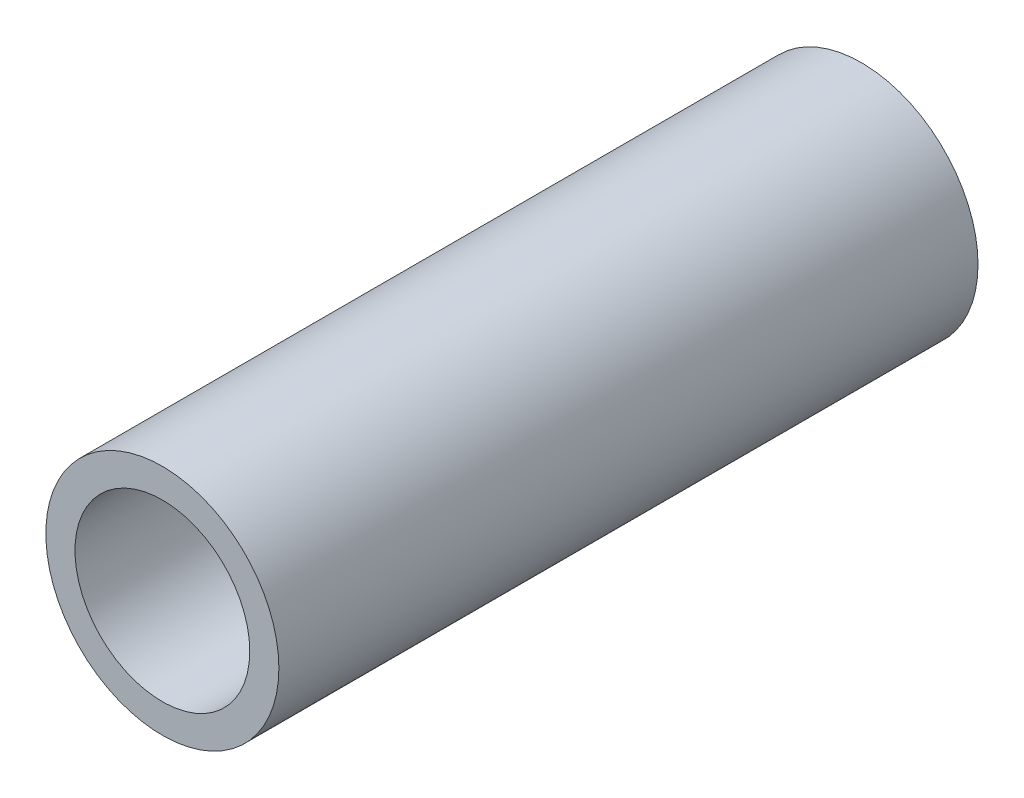
ISO-10303-21;
HEADER;
FILE_DESCRIPTION(('STEP AP214'),'2;1');
FILE_NAME('part.step','',(''),(''),'','','');
FILE_SCHEMA(('AUTOMOTIVE_DESIGN { 1 0 10303 214 1 1 1 1 }'));
ENDSEC;
DATA;
#1=APPLICATION_CONTEXT('core data for automotive mechanical design processes');
#2=APPLICATION_PROTOCOL_DEFINITION('international standard','automotive_design',2000,#1);
#3=PRODUCT_CONTEXT('',#1,'mechanical');
#4=PRODUCT('Part','Part','',(#3));
#5=PRODUCT_RELATED_PRODUCT_CATEGORY('part','',(#4));
#6=PRODUCT_DEFINITION_FORMATION('','',#4);
#7=PRODUCT_DEFINITION_CONTEXT('part definition',#1,'design');
#8=PRODUCT_DEFINITION('design','',#6,#7);
#9=PRODUCT_DEFINITION_SHAPE('','',#8);
#10=(LENGTH_UNIT() NAMED_UNIT(*) SI_UNIT(.MILLI.,.METRE.));
#11=(NAMED_UNIT(*) PLANE_ANGLE_UNIT() SI_UNIT($,.RADIAN.));
#12=(NAMED_UNIT(*) SI_UNIT($,.STERADIAN.) SOLID_ANGLE_UNIT());
#13=UNCERTAINTY_MEASURE_WITH_UNIT(LENGTH_MEASURE(1.E-05),#10,'distance_accuracy_value','');
#14=(GEOMETRIC_REPRESENTATION_CONTEXT(3) GLOBAL_UNCERTAINTY_ASSIGNED_CONTEXT((#13)) GLOBAL_UNIT_ASSIGNED_CONTEXT((#10,
#11,#12)) REPRESENTATION_CONTEXT('',''));
#15=CARTESIAN_POINT('',(0.,0.,0.));
#16=DIRECTION('',(0.,0.,1.));
#17=DIRECTION('',(1.,0.,0.));
#18=AXIS2_PLACEMENT_3D('',#15,#16,#17);
#19=CARTESIAN_POINT('',(0.,0.,76.2));
#20=DIRECTION('',(0.,0.,1.));
#21=DIRECTION('',(1.,0.,0.));
#22=AXIS2_PLACEMENT_3D('',#19,#20,#21);
#23=CYLINDRICAL_SURFACE('',#22,9.525);
#24=CARTESIAN_POINT('',(0.,0.,76.2));
#25=DIRECTION('',(0.,0.,1.));
#26=DIRECTION('',(1.,0.,0.));
#27=AXIS2_PLACEMENT_3D('',#24,#25,#26);
#28=CIRCLE('',#27,9.525);
#29=CARTESIAN_POINT('',(9.525,0.,76.2));
#30=VERTEX_POINT('',#29);
#31=EDGE_CURVE('E17',#30,#30,#28,.F.);
#32=ORIENTED_EDGE('',*,*,#31,.F.);
#33=EDGE_LOOP('',(#32));
#34=FACE_BOUND('',#33,.T.);
#35=CARTESIAN_POINT('',(0.,0.,0.));
#36=DIRECTION('',(0.,0.,1.));
#37=DIRECTION('',(1.,0.,0.));
#38=AXIS2_PLACEMENT_3D('',#35,#36,#37);
#39=CIRCLE('',#38,9.525);
#40=CARTESIAN_POINT('',(9.525,0.,0.));
#41=VERTEX_POINT('',#40);
#42=EDGE_CURVE('E26',#41,#41,#39,.F.);
#43=ORIENTED_EDGE('',*,*,#42,.T.);
#44=EDGE_LOOP('',(#43));
#45=FACE_BOUND('',#44,.T.);
#46=ADVANCED_FACE('F14',(#34,#45),#23,.F.);
#47=CARTESIAN_POINT('',(0.,0.,76.2));
#48=DIRECTION('',(0.,0.,1.));
#49=DIRECTION('',(1.,0.,0.));
#50=AXIS2_PLACEMENT_3D('',#47,#48,#49);
#51=PLANE('',#50);
#52=ORIENTED_EDGE('',*,*,#31,.T.);
#53=EDGE_LOOP('',(#52));
#54=FACE_BOUND('',#53,.T.);
#55=CARTESIAN_POINT('',(0.,0.,76.2));
#56=DIRECTION('',(0.,0.,1.));
#57=DIRECTION('',(1.,0.,0.));
#58=AXIS2_PLACEMENT_3D('',#55,#56,#57);
#59=CIRCLE('',#58,12.7);
#60=CARTESIAN_POINT('',(12.7,0.,76.2));
#61=VERTEX_POINT('',#60);
#62=EDGE_CURVE('E21',#61,#61,#59,.F.);
#63=ORIENTED_EDGE('',*,*,#62,.F.);
#64=EDGE_LOOP('',(#63));
#65=FACE_BOUND('',#64,.T.);
#66=ADVANCED_FACE('F34',(#54,#65),#51,.T.);
#67=CARTESIAN_POINT('',(0.,0.,0.));
#68=DIRECTION('',(0.,0.,1.));
#69=DIRECTION('',(1.,0.,0.));
#70=AXIS2_PLACEMENT_3D('',#67,#68,#69);
#71=PLANE('',#70);
#72=ORIENTED_EDGE('',*,*,#42,.F.);
#73=EDGE_LOOP('',(#72));
#74=FACE_BOUND('',#73,.T.);
#75=CARTESIAN_POINT('',(0.,0.,0.));
#76=DIRECTION('',(0.,0.,1.));
#77=DIRECTION('',(1.,0.,0.));
#78=AXIS2_PLACEMENT_3D('',#75,#76,#77);
#79=CIRCLE('',#78,12.7);
#80=CARTESIAN_POINT('',(12.7,0.,0.));
#81=VERTEX_POINT('',#80);
#82=EDGE_CURVE('E9',#81,#81,#79,.T.);
#83=ORIENTED_EDGE('',*,*,#82,.F.);
#84=EDGE_LOOP('',(#83));
#85=FACE_BOUND('',#84,.T.);
#86=ADVANCED_FACE('F42',(#74,#85),#71,.F.);
#87=CARTESIAN_POINT('',(0.,0.,0.));
#88=DIRECTION('',(0.,0.,1.));
#89=DIRECTION('',(1.,0.,0.));
#90=AXIS2_PLACEMENT_3D('',#87,#88,#89);
#91=CYLINDRICAL_SURFACE('',#90,12.7);
#92=ORIENTED_EDGE('',*,*,#62,.T.);
#93=EDGE_LOOP('',(#92));
#94=FACE_BOUND('',#93,.T.);
#95=ORIENTED_EDGE('',*,*,#82,.T.);
#96=EDGE_LOOP('',(#95));
#97=FACE_BOUND('',#96,.T.);
#98=ADVANCED_FACE('F43',(#94,#97),#91,.T.);
#99=CLOSED_SHELL('',(#46,#66,#86,#98));
#100=MANIFOLD_SOLID_BREP('B1',#99);
#101=ADVANCED_BREP_SHAPE_REPRESENTATION('',(#18,#100),#14);
#102=SHAPE_DEFINITION_REPRESENTATION(#9,#101);
ENDSEC;
END-ISO-10303-21;
